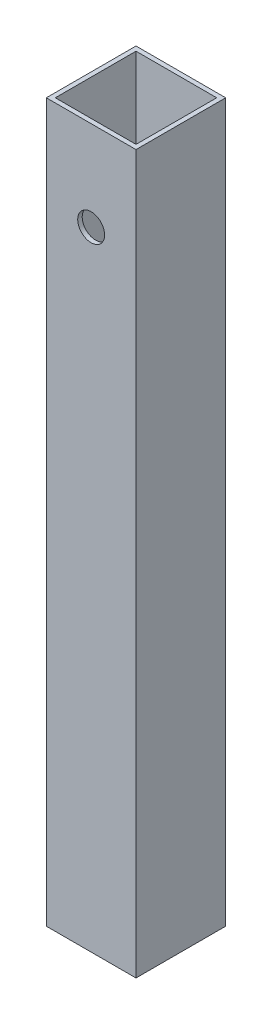
ISO-10303-21;
HEADER;
FILE_DESCRIPTION(('STEP AP214'),'2;1');
FILE_NAME('part.step','',(''),(''),'','','');
FILE_SCHEMA(('AUTOMOTIVE_DESIGN { 1 0 10303 214 1 1 1 1 }'));
ENDSEC;
DATA;
#1=APPLICATION_CONTEXT('core data for automotive mechanical design processes');
#2=APPLICATION_PROTOCOL_DEFINITION('international standard','automotive_design',2000,#1);
#3=PRODUCT_CONTEXT('',#1,'mechanical');
#4=PRODUCT('Part','Part','',(#3));
#5=PRODUCT_RELATED_PRODUCT_CATEGORY('part','',(#4));
#6=PRODUCT_DEFINITION_FORMATION('','',#4);
#7=PRODUCT_DEFINITION_CONTEXT('part definition',#1,'design');
#8=PRODUCT_DEFINITION('design','',#6,#7);
#9=PRODUCT_DEFINITION_SHAPE('','',#8);
#10=(LENGTH_UNIT() NAMED_UNIT(*) SI_UNIT(.MILLI.,.METRE.));
#11=(NAMED_UNIT(*) PLANE_ANGLE_UNIT() SI_UNIT($,.RADIAN.));
#12=(NAMED_UNIT(*) SI_UNIT($,.STERADIAN.) SOLID_ANGLE_UNIT());
#13=UNCERTAINTY_MEASURE_WITH_UNIT(LENGTH_MEASURE(1.E-05),#10,'distance_accuracy_value','');
#14=(GEOMETRIC_REPRESENTATION_CONTEXT(3) GLOBAL_UNCERTAINTY_ASSIGNED_CONTEXT((#13)) GLOBAL_UNIT_ASSIGNED_CONTEXT((#10,
#11,#12)) REPRESENTATION_CONTEXT('',''));
#15=CARTESIAN_POINT('',(0.,0.,0.));
#16=DIRECTION('',(0.,0.,1.));
#17=DIRECTION('',(1.,0.,0.));
#18=AXIS2_PLACEMENT_3D('',#15,#16,#17);
#19=CARTESIAN_POINT('',(0.,140.,0.));
#20=DIRECTION('',(0.,1.,0.));
#21=DIRECTION('',(0.,0.,1.));
#22=AXIS2_PLACEMENT_3D('',#19,#20,#21);
#23=PLANE('',#22);
#24=DIRECTION('',(0.,0.,1.));
#25=VECTOR('',#24,1.);
#26=CARTESIAN_POINT('',(-10.,140.,-10.));
#27=LINE('',#26,#25);
#28=CARTESIAN_POINT('',(-10.,140.,-10.));
#29=VERTEX_POINT('',#28);
#30=CARTESIAN_POINT('',(-9.99999999999999,140.,10.));
#31=VERTEX_POINT('',#30);
#32=EDGE_CURVE('E105',#29,#31,#27,.T.);
#33=ORIENTED_EDGE('',*,*,#32,.T.);
#34=DIRECTION('',(1.,0.,0.));
#35=VECTOR('',#34,1.);
#36=CARTESIAN_POINT('',(-9.99999999999999,140.,10.));
#37=LINE('',#36,#35);
#38=CARTESIAN_POINT('',(10.,140.,10.));
#39=VERTEX_POINT('',#38);
#40=EDGE_CURVE('E158',#31,#39,#37,.T.);
#41=ORIENTED_EDGE('',*,*,#40,.T.);
#42=DIRECTION('',(0.,0.,-1.));
#43=VECTOR('',#42,1.);
#44=CARTESIAN_POINT('',(10.,140.,-10.));
#45=LINE('',#44,#43);
#46=CARTESIAN_POINT('',(10.,140.,-10.));
#47=VERTEX_POINT('',#46);
#48=EDGE_CURVE('E160',#39,#47,#45,.T.);
#49=ORIENTED_EDGE('',*,*,#48,.T.);
#50=DIRECTION('',(-1.,0.,0.));
#51=VECTOR('',#50,1.);
#52=CARTESIAN_POINT('',(-10.,140.,-10.));
#53=LINE('',#52,#51);
#54=EDGE_CURVE('E58',#47,#29,#53,.T.);
#55=ORIENTED_EDGE('',*,*,#54,.T.);
#56=EDGE_LOOP('',(#33,#41,#49,#55));
#57=FACE_BOUND('',#56,.T.);
#58=DIRECTION('',(1.,0.,0.));
#59=VECTOR('',#58,1.);
#60=CARTESIAN_POINT('',(-9.,140.,9.));
#61=LINE('',#60,#59);
#62=CARTESIAN_POINT('',(-9.,140.,9.));
#63=VERTEX_POINT('',#62);
#64=CARTESIAN_POINT('',(9.00000000000001,140.,9.));
#65=VERTEX_POINT('',#64);
#66=EDGE_CURVE('E132',#63,#65,#61,.T.);
#67=ORIENTED_EDGE('',*,*,#66,.F.);
#68=DIRECTION('',(0.,0.,1.));
#69=VECTOR('',#68,1.);
#70=CARTESIAN_POINT('',(-9.,140.,-9.));
#71=LINE('',#70,#69);
#72=CARTESIAN_POINT('',(-9.,140.,-9.));
#73=VERTEX_POINT('',#72);
#74=EDGE_CURVE('E130',#73,#63,#71,.T.);
#75=ORIENTED_EDGE('',*,*,#74,.F.);
#76=DIRECTION('',(-1.,0.,0.));
#77=VECTOR('',#76,1.);
#78=CARTESIAN_POINT('',(-9.,140.,-9.));
#79=LINE('',#78,#77);
#80=CARTESIAN_POINT('',(9.,140.,-9.));
#81=VERTEX_POINT('',#80);
#82=EDGE_CURVE('E137',#81,#73,#79,.T.);
#83=ORIENTED_EDGE('',*,*,#82,.F.);
#84=DIRECTION('',(0.,0.,-1.));
#85=VECTOR('',#84,1.);
#86=CARTESIAN_POINT('',(9.,140.,-9.));
#87=LINE('',#86,#85);
#88=EDGE_CURVE('E135',#65,#81,#87,.T.);
#89=ORIENTED_EDGE('',*,*,#88,.F.);
#90=EDGE_LOOP('',(#67,#75,#83,#89));
#91=FACE_BOUND('',#90,.T.);
#92=ADVANCED_FACE('F34',(#57,#91),#23,.T.);
#93=CARTESIAN_POINT('',(-10.,140.,-10.));
#94=DIRECTION('',(1.,0.,0.));
#95=DIRECTION('',(0.,0.,-1.));
#96=AXIS2_PLACEMENT_3D('',#93,#94,#95);
#97=PLANE('',#96);
#98=DIRECTION('',(0.,-1.,0.));
#99=VECTOR('',#98,1.);
#100=CARTESIAN_POINT('',(-10.,140.,-10.));
#101=LINE('',#100,#99);
#102=CARTESIAN_POINT('',(-9.99999999999999,-20.,-10.));
#103=VERTEX_POINT('',#102);
#104=EDGE_CURVE('E100',#29,#103,#101,.T.);
#105=ORIENTED_EDGE('',*,*,#104,.T.);
#106=DIRECTION('',(0.,0.,-1.));
#107=VECTOR('',#106,1.);
#108=CARTESIAN_POINT('',(-9.99999999999999,-20.,10.));
#109=LINE('',#108,#107);
#110=CARTESIAN_POINT('',(-9.99999999999999,-20.,10.));
#111=VERTEX_POINT('',#110);
#112=EDGE_CURVE('E104',#111,#103,#109,.T.);
#113=ORIENTED_EDGE('',*,*,#112,.F.);
#114=DIRECTION('',(0.,-1.,0.));
#115=VECTOR('',#114,1.);
#116=CARTESIAN_POINT('',(-9.99999999999999,140.,10.));
#117=LINE('',#116,#115);
#118=EDGE_CURVE('E11',#31,#111,#117,.T.);
#119=ORIENTED_EDGE('',*,*,#118,.F.);
#120=ORIENTED_EDGE('',*,*,#32,.F.);
#121=EDGE_LOOP('',(#105,#113,#119,#120));
#122=FACE_BOUND('',#121,.T.);
#123=ADVANCED_FACE('F36',(#122),#97,.F.);
#124=CARTESIAN_POINT('',(-9.99999999999999,140.,10.));
#125=DIRECTION('',(0.,0.,-1.));
#126=DIRECTION('',(-1.,0.,0.));
#127=AXIS2_PLACEMENT_3D('',#124,#125,#126);
#128=PLANE('',#127);
#129=CARTESIAN_POINT('',(0.,120.,10.));
#130=DIRECTION('',(0.,0.,1.));
#131=DIRECTION('',(1.,0.,0.));
#132=AXIS2_PLACEMENT_3D('',#129,#130,#131);
#133=CIRCLE('',#132,3.);
#134=CARTESIAN_POINT('',(3.,120.,10.));
#135=VERTEX_POINT('',#134);
#136=EDGE_CURVE('E124',#135,#135,#133,.T.);
#137=ORIENTED_EDGE('',*,*,#136,.F.);
#138=EDGE_LOOP('',(#137));
#139=FACE_BOUND('',#138,.T.);
#140=ORIENTED_EDGE('',*,*,#118,.T.);
#141=DIRECTION('',(-1.,0.,0.));
#142=VECTOR('',#141,1.);
#143=CARTESIAN_POINT('',(-9.99999999999999,-20.,10.));
#144=LINE('',#143,#142);
#145=CARTESIAN_POINT('',(10.,-20.,10.));
#146=VERTEX_POINT('',#145);
#147=EDGE_CURVE('E121',#146,#111,#144,.T.);
#148=ORIENTED_EDGE('',*,*,#147,.F.);
#149=DIRECTION('',(0.,-1.,0.));
#150=VECTOR('',#149,1.);
#151=CARTESIAN_POINT('',(10.,140.,10.));
#152=LINE('',#151,#150);
#153=EDGE_CURVE('E43',#39,#146,#152,.T.);
#154=ORIENTED_EDGE('',*,*,#153,.F.);
#155=ORIENTED_EDGE('',*,*,#40,.F.);
#156=EDGE_LOOP('',(#140,#148,#154,#155));
#157=FACE_BOUND('',#156,.T.);
#158=ADVANCED_FACE('F169',(#139,#157),#128,.F.);
#159=CARTESIAN_POINT('',(10.,140.,-10.));
#160=DIRECTION('',(-1.,0.,0.));
#161=DIRECTION('',(0.,0.,1.));
#162=AXIS2_PLACEMENT_3D('',#159,#160,#161);
#163=PLANE('',#162);
#164=ORIENTED_EDGE('',*,*,#153,.T.);
#165=DIRECTION('',(0.,0.,1.));
#166=VECTOR('',#165,1.);
#167=CARTESIAN_POINT('',(10.,-20.,10.));
#168=LINE('',#167,#166);
#169=CARTESIAN_POINT('',(10.,-20.,-10.));
#170=VERTEX_POINT('',#169);
#171=EDGE_CURVE('E116',#170,#146,#168,.T.);
#172=ORIENTED_EDGE('',*,*,#171,.F.);
#173=DIRECTION('',(0.,-1.,0.));
#174=VECTOR('',#173,1.);
#175=CARTESIAN_POINT('',(10.,140.,-10.));
#176=LINE('',#175,#174);
#177=EDGE_CURVE('E107',#47,#170,#176,.T.);
#178=ORIENTED_EDGE('',*,*,#177,.F.);
#179=ORIENTED_EDGE('',*,*,#48,.F.);
#180=EDGE_LOOP('',(#164,#172,#178,#179));
#181=FACE_BOUND('',#180,.T.);
#182=ADVANCED_FACE('F167',(#181),#163,.F.);
#183=CARTESIAN_POINT('',(-10.,140.,-10.));
#184=DIRECTION('',(0.,0.,1.));
#185=DIRECTION('',(1.,0.,0.));
#186=AXIS2_PLACEMENT_3D('',#183,#184,#185);
#187=PLANE('',#186);
#188=ORIENTED_EDGE('',*,*,#177,.T.);
#189=DIRECTION('',(1.,0.,0.));
#190=VECTOR('',#189,1.);
#191=CARTESIAN_POINT('',(-9.99999999999999,-20.,-10.));
#192=LINE('',#191,#190);
#193=EDGE_CURVE('E110',#103,#170,#192,.T.);
#194=ORIENTED_EDGE('',*,*,#193,.F.);
#195=ORIENTED_EDGE('',*,*,#104,.F.);
#196=ORIENTED_EDGE('',*,*,#54,.F.);
#197=EDGE_LOOP('',(#188,#194,#195,#196));
#198=FACE_BOUND('',#197,.T.);
#199=ADVANCED_FACE('F111',(#198),#187,.F.);
#200=CARTESIAN_POINT('',(-9.,140.,-9.));
#201=DIRECTION('',(1.,0.,0.));
#202=DIRECTION('',(0.,0.,-1.));
#203=AXIS2_PLACEMENT_3D('',#200,#201,#202);
#204=PLANE('',#203);
#205=DIRECTION('',(0.,0.,1.));
#206=VECTOR('',#205,1.);
#207=CARTESIAN_POINT('',(-9.,0.,-9.));
#208=LINE('',#207,#206);
#209=CARTESIAN_POINT('',(-9.,0.,-9.));
#210=VERTEX_POINT('',#209);
#211=CARTESIAN_POINT('',(-9.,0.,9.));
#212=VERTEX_POINT('',#211);
#213=EDGE_CURVE('E129',#210,#212,#208,.T.);
#214=ORIENTED_EDGE('',*,*,#213,.F.);
#215=DIRECTION('',(0.,-1.,0.));
#216=VECTOR('',#215,1.);
#217=CARTESIAN_POINT('',(-9.,140.,-9.));
#218=LINE('',#217,#216);
#219=EDGE_CURVE('E139',#73,#210,#218,.T.);
#220=ORIENTED_EDGE('',*,*,#219,.F.);
#221=ORIENTED_EDGE('',*,*,#74,.T.);
#222=DIRECTION('',(0.,-1.,0.));
#223=VECTOR('',#222,1.);
#224=CARTESIAN_POINT('',(-9.,140.,9.));
#225=LINE('',#224,#223);
#226=EDGE_CURVE('E154',#63,#212,#225,.T.);
#227=ORIENTED_EDGE('',*,*,#226,.T.);
#228=EDGE_LOOP('',(#214,#220,#221,#227));
#229=FACE_BOUND('',#228,.T.);
#230=ADVANCED_FACE('F188',(#229),#204,.T.);
#231=CARTESIAN_POINT('',(-9.,140.,9.));
#232=DIRECTION('',(0.,0.,-1.));
#233=DIRECTION('',(-1.,0.,0.));
#234=AXIS2_PLACEMENT_3D('',#231,#232,#233);
#235=PLANE('',#234);
#236=CARTESIAN_POINT('',(0.,120.,9.));
#237=DIRECTION('',(0.,0.,-1.));
#238=DIRECTION('',(-1.,0.,0.));
#239=AXIS2_PLACEMENT_3D('',#236,#237,#238);
#240=CIRCLE('',#239,3.);
#241=CARTESIAN_POINT('',(-3.,120.,9.));
#242=VERTEX_POINT('',#241);
#243=EDGE_CURVE('E38',#242,#242,#240,.T.);
#244=ORIENTED_EDGE('',*,*,#243,.F.);
#245=EDGE_LOOP('',(#244));
#246=FACE_BOUND('',#245,.T.);
#247=DIRECTION('',(1.,0.,0.));
#248=VECTOR('',#247,1.);
#249=CARTESIAN_POINT('',(-9.,0.,9.));
#250=LINE('',#249,#248);
#251=CARTESIAN_POINT('',(9.00000000000001,0.,9.));
#252=VERTEX_POINT('',#251);
#253=EDGE_CURVE('E142',#212,#252,#250,.T.);
#254=ORIENTED_EDGE('',*,*,#253,.F.);
#255=ORIENTED_EDGE('',*,*,#226,.F.);
#256=ORIENTED_EDGE('',*,*,#66,.T.);
#257=DIRECTION('',(0.,-1.,0.));
#258=VECTOR('',#257,1.);
#259=CARTESIAN_POINT('',(9.00000000000001,140.,9.));
#260=LINE('',#259,#258);
#261=EDGE_CURVE('E152',#65,#252,#260,.T.);
#262=ORIENTED_EDGE('',*,*,#261,.T.);
#263=EDGE_LOOP('',(#254,#255,#256,#262));
#264=FACE_BOUND('',#263,.T.);
#265=ADVANCED_FACE('F180',(#246,#264),#235,.T.);
#266=CARTESIAN_POINT('',(9.,140.,-9.));
#267=DIRECTION('',(-1.,0.,0.));
#268=DIRECTION('',(0.,0.,1.));
#269=AXIS2_PLACEMENT_3D('',#266,#267,#268);
#270=PLANE('',#269);
#271=DIRECTION('',(0.,0.,-1.));
#272=VECTOR('',#271,1.);
#273=CARTESIAN_POINT('',(9.,0.,-9.));
#274=LINE('',#273,#272);
#275=CARTESIAN_POINT('',(9.,0.,-9.));
#276=VERTEX_POINT('',#275);
#277=EDGE_CURVE('E145',#252,#276,#274,.T.);
#278=ORIENTED_EDGE('',*,*,#277,.F.);
#279=ORIENTED_EDGE('',*,*,#261,.F.);
#280=ORIENTED_EDGE('',*,*,#88,.T.);
#281=DIRECTION('',(0.,-1.,0.));
#282=VECTOR('',#281,1.);
#283=CARTESIAN_POINT('',(9.,140.,-9.));
#284=LINE('',#283,#282);
#285=EDGE_CURVE('E50',#81,#276,#284,.T.);
#286=ORIENTED_EDGE('',*,*,#285,.T.);
#287=EDGE_LOOP('',(#278,#279,#280,#286));
#288=FACE_BOUND('',#287,.T.);
#289=ADVANCED_FACE('F183',(#288),#270,.T.);
#290=CARTESIAN_POINT('',(-9.,140.,-9.));
#291=DIRECTION('',(0.,0.,1.));
#292=DIRECTION('',(1.,0.,0.));
#293=AXIS2_PLACEMENT_3D('',#290,#291,#292);
#294=PLANE('',#293);
#295=DIRECTION('',(-1.,0.,0.));
#296=VECTOR('',#295,1.);
#297=CARTESIAN_POINT('',(-9.,0.,-9.));
#298=LINE('',#297,#296);
#299=EDGE_CURVE('E133',#276,#210,#298,.T.);
#300=ORIENTED_EDGE('',*,*,#299,.F.);
#301=ORIENTED_EDGE('',*,*,#285,.F.);
#302=ORIENTED_EDGE('',*,*,#82,.T.);
#303=ORIENTED_EDGE('',*,*,#219,.T.);
#304=EDGE_LOOP('',(#300,#301,#302,#303));
#305=FACE_BOUND('',#304,.T.);
#306=ADVANCED_FACE('F190',(#305),#294,.T.);
#307=CARTESIAN_POINT('',(0.,0.,0.));
#308=DIRECTION('',(0.,-1.,0.));
#309=DIRECTION('',(0.,0.,-1.));
#310=AXIS2_PLACEMENT_3D('',#307,#308,#309);
#311=PLANE('',#310);
#312=ORIENTED_EDGE('',*,*,#299,.T.);
#313=ORIENTED_EDGE('',*,*,#213,.T.);
#314=ORIENTED_EDGE('',*,*,#253,.T.);
#315=ORIENTED_EDGE('',*,*,#277,.T.);
#316=EDGE_LOOP('',(#312,#313,#314,#315));
#317=FACE_BOUND('',#316,.T.);
#318=ADVANCED_FACE('F185',(#317),#311,.F.);
#319=CARTESIAN_POINT('',(0.,-20.,0.));
#320=DIRECTION('',(0.,-1.,0.));
#321=DIRECTION('',(0.,0.,-1.));
#322=AXIS2_PLACEMENT_3D('',#319,#320,#321);
#323=PLANE('',#322);
#324=ORIENTED_EDGE('',*,*,#112,.T.);
#325=ORIENTED_EDGE('',*,*,#193,.T.);
#326=ORIENTED_EDGE('',*,*,#171,.T.);
#327=ORIENTED_EDGE('',*,*,#147,.T.);
#328=EDGE_LOOP('',(#324,#325,#326,#327));
#329=FACE_BOUND('',#328,.T.);
#330=ADVANCED_FACE('F119',(#329),#323,.T.);
#331=CARTESIAN_POINT('',(0.,120.,8.));
#332=DIRECTION('',(0.,0.,1.));
#333=DIRECTION('',(1.,0.,0.));
#334=AXIS2_PLACEMENT_3D('',#331,#332,#333);
#335=CYLINDRICAL_SURFACE('',#334,3.);
#336=ORIENTED_EDGE('',*,*,#243,.T.);
#337=EDGE_LOOP('',(#336));
#338=FACE_BOUND('',#337,.T.);
#339=ORIENTED_EDGE('',*,*,#136,.T.);
#340=EDGE_LOOP('',(#339));
#341=FACE_BOUND('',#340,.T.);
#342=ADVANCED_FACE('F217',(#338,#341),#335,.F.);
#343=CLOSED_SHELL('',(#92,#123,#158,#182,#199,#230,#265,#289,#306,#318,#330,#342));
#344=MANIFOLD_SOLID_BREP('B2',#343);
#345=ADVANCED_BREP_SHAPE_REPRESENTATION('',(#18,#344),#14);
#346=SHAPE_DEFINITION_REPRESENTATION(#9,#345);
ENDSEC;
END-ISO-10303-21;
